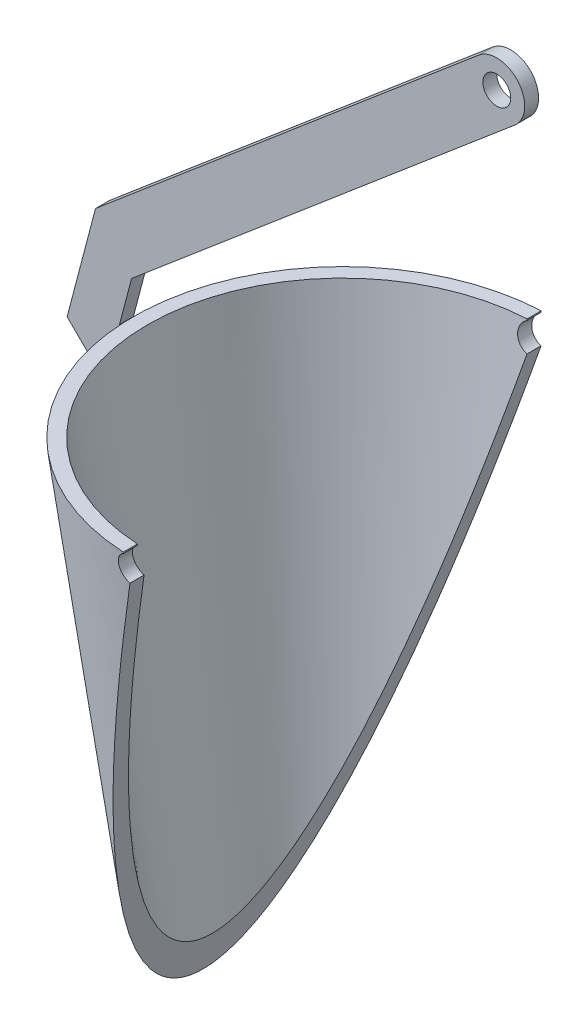
ISO-10303-21;
HEADER;
FILE_DESCRIPTION(('STEP AP214'),'2;1');
FILE_NAME('part.step','',(''),(''),'','','');
FILE_SCHEMA(('AUTOMOTIVE_DESIGN { 1 0 10303 214 1 1 1 1 }'));
ENDSEC;
DATA;
#1=APPLICATION_CONTEXT('core data for automotive mechanical design processes');
#2=APPLICATION_PROTOCOL_DEFINITION('international standard','automotive_design',2000,#1);
#3=PRODUCT_CONTEXT('',#1,'mechanical');
#4=PRODUCT('Part','Part','',(#3));
#5=PRODUCT_RELATED_PRODUCT_CATEGORY('part','',(#4));
#6=PRODUCT_DEFINITION_FORMATION('','',#4);
#7=PRODUCT_DEFINITION_CONTEXT('part definition',#1,'design');
#8=PRODUCT_DEFINITION('design','',#6,#7);
#9=PRODUCT_DEFINITION_SHAPE('','',#8);
#10=(LENGTH_UNIT() NAMED_UNIT(*) SI_UNIT(.MILLI.,.METRE.));
#11=(NAMED_UNIT(*) PLANE_ANGLE_UNIT() SI_UNIT($,.RADIAN.));
#12=(NAMED_UNIT(*) SI_UNIT($,.STERADIAN.) SOLID_ANGLE_UNIT());
#13=UNCERTAINTY_MEASURE_WITH_UNIT(LENGTH_MEASURE(1.E-05),#10,'distance_accuracy_value','');
#14=(GEOMETRIC_REPRESENTATION_CONTEXT(3) GLOBAL_UNCERTAINTY_ASSIGNED_CONTEXT((#13)) GLOBAL_UNIT_ASSIGNED_CONTEXT((#10,
#11,#12)) REPRESENTATION_CONTEXT('',''));
#15=CARTESIAN_POINT('',(0.,0.,0.));
#16=DIRECTION('',(0.,0.,1.));
#17=DIRECTION('',(1.,0.,0.));
#18=AXIS2_PLACEMENT_3D('',#15,#16,#17);
#19=CARTESIAN_POINT('',(38.2571990142961,89.1823743155606,3.175));
#20=DIRECTION('',(0.,0.,1.));
#21=DIRECTION('',(1.,0.,0.));
#22=AXIS2_PLACEMENT_3D('',#19,#20,#21);
#23=PLANE('',#22);
#24=DIRECTION('',(0.25449329927965,0.967074537262645,0.));
#25=VECTOR('',#24,1.);
#26=CARTESIAN_POINT('',(-47.625,0.,3.175));
#27=LINE('',#26,#25);
#28=CARTESIAN_POINT('',(-47.625,0.,3.175));
#29=VERTEX_POINT('',#28);
#30=CARTESIAN_POINT('',(-44.8685427340684,10.4745376105398,3.175));
#31=VERTEX_POINT('',#30);
#32=EDGE_CURVE('E148',#29,#31,#27,.T.);
#33=ORIENTED_EDGE('',*,*,#32,.T.);
#34=DIRECTION('',(0.763159873131717,0.646209724502488,0.));
#35=VECTOR('',#34,1.);
#36=CARTESIAN_POINT('',(42.3606307648869,84.3363091211743,3.175));
#37=LINE('',#36,#35);
#38=CARTESIAN_POINT('',(42.3606307648869,84.3363091211743,3.175));
#39=VERTEX_POINT('',#38);
#40=EDGE_CURVE('E101',#31,#39,#37,.T.);
#41=ORIENTED_EDGE('',*,*,#40,.T.);
#42=CARTESIAN_POINT('',(38.2571990142961,89.1823743155606,3.175));
#43=DIRECTION('',(0.,0.,1.));
#44=DIRECTION('',(1.,0.,0.));
#45=AXIS2_PLACEMENT_3D('',#42,#43,#44);
#46=CIRCLE('',#45,6.35);
#47=CARTESIAN_POINT('',(34.1537672637053,94.0284395099471,3.175));
#48=VERTEX_POINT('',#47);
#49=EDGE_CURVE('E160',#39,#48,#46,.T.);
#50=ORIENTED_EDGE('',*,*,#49,.T.);
#51=DIRECTION('',(-0.763159873131717,-0.646209724502488,0.));
#52=VECTOR('',#51,1.);
#53=CARTESIAN_POINT('',(-53.0754062352499,20.1666679993127,3.175));
#54=LINE('',#53,#52);
#55=CARTESIAN_POINT('',(-53.0754062352499,20.1666679993127,3.175));
#56=VERTEX_POINT('',#55);
#57=EDGE_CURVE('E117',#48,#56,#54,.T.);
#58=ORIENTED_EDGE('',*,*,#57,.T.);
#59=DIRECTION('',(-0.254493299279644,-0.967074537262646,0.));
#60=VECTOR('',#59,1.);
#61=CARTESIAN_POINT('',(-59.5395360369529,-4.39702524715854,3.175));
#62=LINE('',#61,#60);
#63=CARTESIAN_POINT('',(-59.5395360369529,-4.39702524715854,3.175));
#64=VERTEX_POINT('',#63);
#65=EDGE_CURVE('E111',#56,#64,#62,.T.);
#66=ORIENTED_EDGE('',*,*,#65,.T.);
#67=DIRECTION('',(0.710264466982709,-0.703934930900413,0.));
#68=VECTOR('',#67,1.);
#69=CARTESIAN_POINT('',(-59.5395360369529,-4.39702524715854,3.175));
#70=LINE('',#69,#68);
#71=CARTESIAN_POINT('',(-45.1729495212973,-18.6355836381403,3.175));
#72=VERTEX_POINT('',#71);
#73=EDGE_CURVE('E115',#64,#72,#70,.T.);
#74=ORIENTED_EDGE('',*,*,#73,.T.);
#75=DIRECTION('',(-0.130454512571388,0.991454295542544,0.));
#76=VECTOR('',#75,1.);
#77=CARTESIAN_POINT('',(-45.1729495212973,-18.6355836381403,3.175));
#78=LINE('',#77,#76);
#79=EDGE_CURVE('E61',#72,#29,#78,.T.);
#80=ORIENTED_EDGE('',*,*,#79,.T.);
#81=EDGE_LOOP('',(#33,#41,#50,#58,#66,#74,#80));
#82=FACE_BOUND('',#81,.T.);
#83=CARTESIAN_POINT('',(38.2571990142961,89.1823743155606,3.175));
#84=DIRECTION('',(0.,0.,1.));
#85=DIRECTION('',(1.,0.,0.));
#86=AXIS2_PLACEMENT_3D('',#83,#84,#85);
#87=CIRCLE('',#86,3.175);
#88=CARTESIAN_POINT('',(41.4321990142961,89.1823743155606,3.175));
#89=VERTEX_POINT('',#88);
#90=EDGE_CURVE('E139',#89,#89,#87,.T.);
#91=ORIENTED_EDGE('',*,*,#90,.F.);
#92=EDGE_LOOP('',(#91));
#93=FACE_BOUND('',#92,.T.);
#94=ADVANCED_FACE('F44',(#82,#93),#23,.T.);
#95=CARTESIAN_POINT('',(38.2571990142961,89.1823743155606,0.));
#96=DIRECTION('',(0.,0.,1.));
#97=DIRECTION('',(1.,0.,0.));
#98=AXIS2_PLACEMENT_3D('',#95,#96,#97);
#99=PLANE('',#98);
#100=DIRECTION('',(0.25449329927965,0.967074537262645,0.));
#101=VECTOR('',#100,1.);
#102=CARTESIAN_POINT('',(-47.625,0.,0.));
#103=LINE('',#102,#101);
#104=CARTESIAN_POINT('',(-47.625,0.,0.));
#105=VERTEX_POINT('',#104);
#106=CARTESIAN_POINT('',(-44.8685427340684,10.4745376105398,0.));
#107=VERTEX_POINT('',#106);
#108=EDGE_CURVE('E135',#105,#107,#103,.T.);
#109=ORIENTED_EDGE('',*,*,#108,.F.);
#110=DIRECTION('',(-0.130454512571388,0.991454295542544,0.));
#111=VECTOR('',#110,1.);
#112=CARTESIAN_POINT('',(-45.1729495212973,-18.6355836381403,0.));
#113=LINE('',#112,#111);
#114=CARTESIAN_POINT('',(-45.1729495212973,-18.6355836381403,0.));
#115=VERTEX_POINT('',#114);
#116=EDGE_CURVE('E93',#115,#105,#113,.T.);
#117=ORIENTED_EDGE('',*,*,#116,.F.);
#118=DIRECTION('',(0.710264466982709,-0.703934930900413,0.));
#119=VECTOR('',#118,1.);
#120=CARTESIAN_POINT('',(-59.5395360369529,-4.39702524715854,0.));
#121=LINE('',#120,#119);
#122=CARTESIAN_POINT('',(-59.5395360369529,-4.39702524715854,0.));
#123=VERTEX_POINT('',#122);
#124=EDGE_CURVE('E87',#123,#115,#121,.T.);
#125=ORIENTED_EDGE('',*,*,#124,.F.);
#126=DIRECTION('',(-0.254493299279644,-0.967074537262646,0.));
#127=VECTOR('',#126,1.);
#128=CARTESIAN_POINT('',(-59.5395360369529,-4.39702524715854,0.));
#129=LINE('',#128,#127);
#130=CARTESIAN_POINT('',(-53.0754062352499,20.1666679993127,0.));
#131=VERTEX_POINT('',#130);
#132=EDGE_CURVE('E125',#131,#123,#129,.T.);
#133=ORIENTED_EDGE('',*,*,#132,.F.);
#134=DIRECTION('',(-0.763159873131717,-0.646209724502488,0.));
#135=VECTOR('',#134,1.);
#136=CARTESIAN_POINT('',(-53.0754062352499,20.1666679993127,0.));
#137=LINE('',#136,#135);
#138=CARTESIAN_POINT('',(34.1537672637053,94.0284395099471,0.));
#139=VERTEX_POINT('',#138);
#140=EDGE_CURVE('E143',#139,#131,#137,.T.);
#141=ORIENTED_EDGE('',*,*,#140,.F.);
#142=CARTESIAN_POINT('',(38.2571990142961,89.1823743155606,0.));
#143=DIRECTION('',(0.,0.,1.));
#144=DIRECTION('',(1.,0.,0.));
#145=AXIS2_PLACEMENT_3D('',#142,#143,#144);
#146=CIRCLE('',#145,6.35);
#147=CARTESIAN_POINT('',(42.3606307648869,84.3363091211743,0.));
#148=VERTEX_POINT('',#147);
#149=EDGE_CURVE('E141',#148,#139,#146,.T.);
#150=ORIENTED_EDGE('',*,*,#149,.F.);
#151=DIRECTION('',(0.763159873131717,0.646209724502488,0.));
#152=VECTOR('',#151,1.);
#153=CARTESIAN_POINT('',(42.3606307648869,84.3363091211743,0.));
#154=LINE('',#153,#152);
#155=EDGE_CURVE('E138',#107,#148,#154,.T.);
#156=ORIENTED_EDGE('',*,*,#155,.F.);
#157=EDGE_LOOP('',(#109,#117,#125,#133,#141,#150,#156));
#158=FACE_BOUND('',#157,.T.);
#159=CARTESIAN_POINT('',(38.2571990142961,89.1823743155606,0.));
#160=DIRECTION('',(0.,0.,1.));
#161=DIRECTION('',(1.,0.,0.));
#162=AXIS2_PLACEMENT_3D('',#159,#160,#161);
#163=CIRCLE('',#162,3.175);
#164=CARTESIAN_POINT('',(41.4321990142961,89.1823743155606,0.));
#165=VERTEX_POINT('',#164);
#166=EDGE_CURVE('E172',#165,#165,#163,.T.);
#167=ORIENTED_EDGE('',*,*,#166,.T.);
#168=EDGE_LOOP('',(#167));
#169=FACE_BOUND('',#168,.T.);
#170=ADVANCED_FACE('F164',(#158,#169),#99,.F.);
#171=CARTESIAN_POINT('',(-47.625,0.,3.175));
#172=DIRECTION('',(-0.967074537262645,0.25449329927965,0.));
#173=DIRECTION('',(-0.25449329927965,-0.967074537262645,0.));
#174=AXIS2_PLACEMENT_3D('',#171,#172,#173);
#175=PLANE('',#174);
#176=ORIENTED_EDGE('',*,*,#108,.T.);
#177=DIRECTION('',(0.,0.,-1.));
#178=VECTOR('',#177,1.);
#179=CARTESIAN_POINT('',(-44.8685427340684,10.4745376105398,3.175));
#180=LINE('',#179,#178);
#181=EDGE_CURVE('E12',#31,#107,#180,.T.);
#182=ORIENTED_EDGE('',*,*,#181,.F.);
#183=ORIENTED_EDGE('',*,*,#32,.F.);
#184=DIRECTION('',(0.,0.,-1.));
#185=VECTOR('',#184,1.);
#186=CARTESIAN_POINT('',(-47.625,0.,3.175));
#187=LINE('',#186,#185);
#188=EDGE_CURVE('E131',#29,#105,#187,.T.);
#189=ORIENTED_EDGE('',*,*,#188,.T.);
#190=EDGE_LOOP('',(#176,#182,#183,#189));
#191=FACE_BOUND('',#190,.T.);
#192=ADVANCED_FACE('F46',(#191),#175,.F.);
#193=CARTESIAN_POINT('',(42.3606307648869,84.3363091211743,3.175));
#194=DIRECTION('',(-0.646209724502488,0.763159873131717,0.));
#195=DIRECTION('',(-0.763159873131717,-0.646209724502488,0.));
#196=AXIS2_PLACEMENT_3D('',#193,#194,#195);
#197=PLANE('',#196);
#198=ORIENTED_EDGE('',*,*,#155,.T.);
#199=DIRECTION('',(0.,0.,-1.));
#200=VECTOR('',#199,1.);
#201=CARTESIAN_POINT('',(42.3606307648869,84.3363091211743,3.175));
#202=LINE('',#201,#200);
#203=EDGE_CURVE('E53',#39,#148,#202,.T.);
#204=ORIENTED_EDGE('',*,*,#203,.F.);
#205=ORIENTED_EDGE('',*,*,#40,.F.);
#206=ORIENTED_EDGE('',*,*,#181,.T.);
#207=EDGE_LOOP('',(#198,#204,#205,#206));
#208=FACE_BOUND('',#207,.T.);
#209=ADVANCED_FACE('F198',(#208),#197,.F.);
#210=CARTESIAN_POINT('',(38.2571990142961,89.1823743155606,3.175));
#211=DIRECTION('',(0.,0.,-1.));
#212=DIRECTION('',(-1.,0.,0.));
#213=AXIS2_PLACEMENT_3D('',#210,#211,#212);
#214=CYLINDRICAL_SURFACE('',#213,6.35);
#215=ORIENTED_EDGE('',*,*,#149,.T.);
#216=DIRECTION('',(0.,0.,-1.));
#217=VECTOR('',#216,1.);
#218=CARTESIAN_POINT('',(34.1537672637053,94.0284395099471,3.175));
#219=LINE('',#218,#217);
#220=EDGE_CURVE('E152',#48,#139,#219,.T.);
#221=ORIENTED_EDGE('',*,*,#220,.F.);
#222=ORIENTED_EDGE('',*,*,#49,.F.);
#223=ORIENTED_EDGE('',*,*,#203,.T.);
#224=EDGE_LOOP('',(#215,#221,#222,#223));
#225=FACE_BOUND('',#224,.T.);
#226=ADVANCED_FACE('F158',(#225),#214,.T.);
#227=CARTESIAN_POINT('',(-53.0754062352499,20.1666679993127,3.175));
#228=DIRECTION('',(0.646209724502488,-0.763159873131717,0.));
#229=DIRECTION('',(0.763159873131717,0.646209724502488,0.));
#230=AXIS2_PLACEMENT_3D('',#227,#228,#229);
#231=PLANE('',#230);
#232=ORIENTED_EDGE('',*,*,#140,.T.);
#233=DIRECTION('',(0.,0.,-1.));
#234=VECTOR('',#233,1.);
#235=CARTESIAN_POINT('',(-53.0754062352499,20.1666679993127,3.175));
#236=LINE('',#235,#234);
#237=EDGE_CURVE('E126',#56,#131,#236,.T.);
#238=ORIENTED_EDGE('',*,*,#237,.F.);
#239=ORIENTED_EDGE('',*,*,#57,.F.);
#240=ORIENTED_EDGE('',*,*,#220,.T.);
#241=EDGE_LOOP('',(#232,#238,#239,#240));
#242=FACE_BOUND('',#241,.T.);
#243=ADVANCED_FACE('F167',(#242),#231,.F.);
#244=CARTESIAN_POINT('',(-59.5395360369529,-4.39702524715854,3.175));
#245=DIRECTION('',(0.967074537262646,-0.254493299279644,0.));
#246=DIRECTION('',(0.254493299279644,0.967074537262646,0.));
#247=AXIS2_PLACEMENT_3D('',#244,#245,#246);
#248=PLANE('',#247);
#249=ORIENTED_EDGE('',*,*,#132,.T.);
#250=DIRECTION('',(0.,0.,-1.));
#251=VECTOR('',#250,1.);
#252=CARTESIAN_POINT('',(-59.5395360369529,-4.39702524715854,3.175));
#253=LINE('',#252,#251);
#254=EDGE_CURVE('E122',#64,#123,#253,.T.);
#255=ORIENTED_EDGE('',*,*,#254,.F.);
#256=ORIENTED_EDGE('',*,*,#65,.F.);
#257=ORIENTED_EDGE('',*,*,#237,.T.);
#258=EDGE_LOOP('',(#249,#255,#256,#257));
#259=FACE_BOUND('',#258,.T.);
#260=ADVANCED_FACE('F123',(#259),#248,.F.);
#261=CARTESIAN_POINT('',(-59.5395360369529,-4.39702524715854,3.175));
#262=DIRECTION('',(0.703934930900413,0.710264466982708,0.));
#263=DIRECTION('',(-0.710264466982708,0.703934930900413,0.));
#264=AXIS2_PLACEMENT_3D('',#261,#262,#263);
#265=PLANE('',#264);
#266=ORIENTED_EDGE('',*,*,#124,.T.);
#267=DIRECTION('',(0.,0.,-1.));
#268=VECTOR('',#267,1.);
#269=CARTESIAN_POINT('',(-45.1729495212973,-18.6355836381403,3.175));
#270=LINE('',#269,#268);
#271=EDGE_CURVE('E127',#72,#115,#270,.T.);
#272=ORIENTED_EDGE('',*,*,#271,.F.);
#273=ORIENTED_EDGE('',*,*,#73,.F.);
#274=ORIENTED_EDGE('',*,*,#254,.T.);
#275=EDGE_LOOP('',(#266,#272,#273,#274));
#276=FACE_BOUND('',#275,.T.);
#277=ADVANCED_FACE('F129',(#276),#265,.F.);
#278=CARTESIAN_POINT('',(-45.1729495212973,-18.6355836381403,3.175));
#279=DIRECTION('',(-0.991454295542544,-0.130454512571388,0.));
#280=DIRECTION('',(0.130454512571388,-0.991454295542544,0.));
#281=AXIS2_PLACEMENT_3D('',#278,#279,#280);
#282=PLANE('',#281);
#283=ORIENTED_EDGE('',*,*,#116,.T.);
#284=ORIENTED_EDGE('',*,*,#188,.F.);
#285=ORIENTED_EDGE('',*,*,#79,.F.);
#286=ORIENTED_EDGE('',*,*,#271,.T.);
#287=EDGE_LOOP('',(#283,#284,#285,#286));
#288=FACE_BOUND('',#287,.T.);
#289=ADVANCED_FACE('F188',(#288),#282,.F.);
#290=CARTESIAN_POINT('',(38.2571990142961,89.1823743155606,3.175));
#291=DIRECTION('',(0.,0.,-1.));
#292=DIRECTION('',(-1.,0.,0.));
#293=AXIS2_PLACEMENT_3D('',#290,#291,#292);
#294=CYLINDRICAL_SURFACE('',#293,3.175);
#295=ORIENTED_EDGE('',*,*,#90,.T.);
#296=EDGE_LOOP('',(#295));
#297=FACE_BOUND('',#296,.T.);
#298=ORIENTED_EDGE('',*,*,#166,.F.);
#299=EDGE_LOOP('',(#298));
#300=FACE_BOUND('',#299,.T.);
#301=ADVANCED_FACE('F178',(#297,#300),#294,.F.);
#302=CLOSED_SHELL('',(#94,#170,#192,#209,#226,#243,#260,#277,#289,#301));
#303=MANIFOLD_SOLID_BREP('B2',#302);
#304=CARTESIAN_POINT('',(0.,0.,0.));
#305=DIRECTION('',(0.,1.,0.));
#306=DIRECTION('',(0.,0.,1.));
#307=AXIS2_PLACEMENT_3D('',#304,#305,#306);
#308=CONICAL_SURFACE('',#307,47.625,0.130827396074057);
#309=CARTESIAN_POINT('',(-2.3576984319281,-85.4257428393814,-36.3083020185411));
#310=CARTESIAN_POINT('',(-2.3576984319281,-74.7891514308423,-37.7107891372062));
#311=CARTESIAN_POINT('',(-2.3576984319281,-64.1525189981991,-39.1129650723552));
#312=CARTESIAN_POINT('',(-2.3576984319281,-42.8791898140212,-41.9168288891303));
#313=CARTESIAN_POINT('',(-2.3576984319281,-32.2424930624864,-43.3185167707568));
#314=CARTESIAN_POINT('',(-2.3576984319281,-15.2228595743059,-45.561050525857));
#315=CARTESIAN_POINT('',(-2.3576984319281,-8.83993774935593,-46.4020095778413));
#316=CARTESIAN_POINT('',(-2.3576984319281,11.3712016125491,-49.0646815310176));
#317=CARTESIAN_POINT('',(-2.3576984319281,25.1994455039221,-50.8861943877959));
#318=CARTESIAN_POINT('',(-2.3576984319281,52.8559826261927,-54.5288454612705));
#319=CARTESIAN_POINT('',(-2.3576984319281,66.6842758570902,-56.349983677967));
#320=CARTESIAN_POINT('',(-2.3576984319281,80.5125849426066,-58.1710014616296));
#321=B_SPLINE_CURVE_WITH_KNOTS('',3,(#309,#310,#311,#312,#313,#314,#315,#316,#317,#318,#319,
#320),.UNSPECIFIED.,.F.,.F.,(4,2,2,2,2,4),(0.,32.1859662162125,64.3719324071345,83.686179178142,
125.529268730431,167.372358267696),.UNSPECIFIED.);
#322=CARTESIAN_POINT('',(-2.3576984319281,-0.299340933395278,-47.5271693458428));
#323=VERTEX_POINT('',#322);
#324=CARTESIAN_POINT('',(-2.3576984319281,0.,-47.5666047043941));
#325=VERTEX_POINT('',#324);
#326=EDGE_CURVE('E316',#323,#325,#321,.T.);
#327=ORIENTED_EDGE('',*,*,#326,.F.);
#328=CARTESIAN_POINT('',(0.0002,-6.14087067307397,-46.8169907004841));
#329=CARTESIAN_POINT('',(-0.0859535615366576,-6.1635575906585,-46.8140083255328));
#330=CARTESIAN_POINT('',(-0.173069972905161,-6.18260256961136,-46.8112626520907));
#331=CARTESIAN_POINT('',(-0.348604181921856,-6.21330914503569,-46.8062428556978));
#332=CARTESIAN_POINT('',(-0.437021924190166,-6.22497105477927,-46.8039687127421));
#333=CARTESIAN_POINT('',(-0.614483808090249,-6.24080874440042,-46.7998912067551));
#334=CARTESIAN_POINT('',(-0.703527501892061,-6.24498941871323,-46.7980875365875));
#335=CARTESIAN_POINT('',(-0.881634578482085,-6.24585885466165,-46.794957010748));
#336=CARTESIAN_POINT('',(-0.97069796098784,-6.24254771758166,-46.7936301486303));
#337=CARTESIAN_POINT('',(-1.23707078071162,-6.22136607338411,-46.7903839699077));
#338=CARTESIAN_POINT('',(-1.41363326367239,-6.1922535546468,-46.7891974465898));
#339=CARTESIAN_POINT('',(-1.75924806261013,-6.1048635127957,-46.7889860982543));
#340=CARTESIAN_POINT('',(-1.92830197095091,-6.0465922059299,-46.7899608126427));
#341=CARTESIAN_POINT('',(-2.2541218904275,-5.90261270866256,-46.7943626040565));
#342=CARTESIAN_POINT('',(-2.41089772227584,-5.81692673094493,-46.7977876984339));
#343=CARTESIAN_POINT('',(-2.70784851609873,-5.62055169907562,-46.8074275887588));
#344=CARTESIAN_POINT('',(-2.84802109967478,-5.50985906933313,-46.8136427837761));
#345=CARTESIAN_POINT('',(-3.10764899424079,-5.26679990758813,-46.8291770152161));
#346=CARTESIAN_POINT('',(-3.22712458900852,-5.1344548459808,-46.838492986303));
#347=CARTESIAN_POINT('',(-3.44217397459419,-4.85185551890092,-46.8604652175612));
#348=CARTESIAN_POINT('',(-3.53774942441571,-4.70160249756036,-46.8731212457604));
#349=CARTESIAN_POINT('',(-3.70248907060873,-4.38733818345879,-46.9018763893385));
#350=CARTESIAN_POINT('',(-3.77162260268284,-4.22331118432241,-46.9179794686758));
#351=CARTESIAN_POINT('',(-3.88150867923253,-3.8863522572301,-46.9535049354716));
#352=CARTESIAN_POINT('',(-3.92225984777483,-3.71341989799241,-46.972927483796));
#353=CARTESIAN_POINT('',(-3.97455966239676,-3.36249807730973,-47.014870183623));
#354=CARTESIAN_POINT('',(-3.98593297661624,-3.1844846347946,-47.037408091211));
#355=CARTESIAN_POINT('',(-3.97882818024165,-2.82938037204817,-47.0849004128425));
#356=CARTESIAN_POINT('',(-3.96034834980661,-2.65228960556192,-47.1098549660313));
#357=CARTESIAN_POINT('',(-3.89384020727525,-2.30207912569136,-47.1616360574095));
#358=CARTESIAN_POINT('',(-3.84550660100344,-2.12901986244251,-47.1884793646362));
#359=CARTESIAN_POINT('',(-3.72044872378317,-1.79358927186742,-47.2427756221344));
#360=CARTESIAN_POINT('',(-3.64372412992355,-1.63121806612892,-47.2702285793364));
#361=CARTESIAN_POINT('',(-3.46328243133634,-1.32039413560554,-47.3247992976463));
#362=CARTESIAN_POINT('',(-3.35935546000028,-1.17206240525648,-47.3519126550963));
#363=CARTESIAN_POINT('',(-3.1275874032091,-0.894952249203227,-47.4043256029943));
#364=CARTESIAN_POINT('',(-2.99973817848236,-0.766180505657205,-47.4296245720531));
#365=CARTESIAN_POINT('',(-2.72401471267033,-0.532312337102052,-47.4770801224201));
#366=CARTESIAN_POINT('',(-2.57618833612549,-0.42716087472294,-47.4992439632404));
#367=CARTESIAN_POINT('',(-2.26449456401252,-0.243467215911044,-47.5393179657162));
#368=CARTESIAN_POINT('',(-2.10065552388843,-0.164879043241523,-47.5572354607902));
#369=CARTESIAN_POINT('',(-1.87958564676588,-0.0812398233384438,-47.5772262368721));
#370=CARTESIAN_POINT('',(-1.82730502204217,-0.0630124158872855,-47.5816637844773));
#371=CARTESIAN_POINT('',(-1.72190806852856,-0.0293315045444924,-47.5900287551245));
#372=CARTESIAN_POINT('',(-1.6687931715082,-0.0138737154337185,-47.5939569635795));
#373=CARTESIAN_POINT('',(-1.61527206789541,0.000199999999974752,-47.5976262824767));
#374=B_SPLINE_CURVE_WITH_KNOTS('',3,(#328,#329,#330,#331,#332,#333,#334,#335,#336,#337,#338,
#339,#340,#341,#342,#343,#344,#345,#346,#347,#348,#349,#350,#351,#352,#353,#354,#355,#356,#357,
#358,#359,#360,#361,#362,#363,#364,#365,#366,#367,#368,#369,#370,#371,#372,#373),.UNSPECIFIED.,
.F.,.F.,(4,2,2,2,2,2,2,2,2,2,2,2,2,2,2,2,2,2,2,2,2,2,4),(0.,0.267334898742274,0.534658453397227,
0.801807053413805,1.06895204177679,1.60303269053914,2.13699952921359,2.67053481331776,
3.20414643361655,3.73723210023411,4.27028075298946,4.80394571341583,5.33763654329753,
5.87450524536216,6.4114048775593,6.95388805872521,7.49637741013286,8.0431821900713,
8.59017335346249,9.13587644356972,9.68063012527912,9.8472096775258,10.0135292254064),.UNSPECIFIED.);
#375=CARTESIAN_POINT('',(-1.61603245042574,-6.1409233116178,-46.7890842920424));
#376=VERTEX_POINT('',#375);
#377=EDGE_CURVE('E337',#376,#323,#374,.T.);
#378=ORIENTED_EDGE('',*,*,#377,.F.);
#379=CARTESIAN_POINT('',(31.7499999999999,120.65,0.));
#380=DIRECTION('',(-0.967074537262646,0.254493299279644,0.));
#381=DIRECTION('',(0.254493299279644,0.967074537262646,0.));
#382=AXIS2_PLACEMENT_3D('',#379,#380,#381);
#383=ELLIPSE('',#382,249.515410345734,54.9926131403118);
#384=CARTESIAN_POINT('',(-1.61603245042574,-6.1409233116178,46.7890842920424));
#385=VERTEX_POINT('',#384);
#386=EDGE_CURVE('E344',#385,#376,#383,.F.);
#387=ORIENTED_EDGE('',*,*,#386,.F.);
#388=CARTESIAN_POINT('',(-1.61527206789541,0.000199999999972751,47.5976262824767));
#389=CARTESIAN_POINT('',(-1.70165680488474,-0.0225005797584953,47.5917080652622));
#390=CARTESIAN_POINT('',(-1.787027770769,-0.048850291645772,47.5851039222109));
#391=CARTESIAN_POINT('',(-1.95514421860819,-0.108593207582253,47.5706243991864));
#392=CARTESIAN_POINT('',(-2.03789007574798,-0.14198539984378,47.5627492018628));
#393=CARTESIAN_POINT('',(-2.2000722524518,-0.215514727377125,47.5458380291236));
#394=CARTESIAN_POINT('',(-2.27951295389418,-0.255642552489486,47.5368036599507));
#395=CARTESIAN_POINT('',(-2.43463709995546,-0.342342250030682,47.5176887062314));
#396=CARTESIAN_POINT('',(-2.51032049591488,-0.388914205885497,47.5076081081409));
#397=CARTESIAN_POINT('',(-2.73095064508586,-0.537803825091363,47.4759848389561));
#398=CARTESIAN_POINT('',(-2.86962225785265,-0.649361203596843,47.4530453469536));
#399=CARTESIAN_POINT('',(-3.12614263053469,-0.893688275587248,47.4046205142511));
#400=CARTESIAN_POINT('',(-3.24399001267651,-1.02645937150904,47.3791350052761));
#401=CARTESIAN_POINT('',(-3.45722665292289,-1.31138545831389,47.3264661795455));
#402=CARTESIAN_POINT('',(-3.55231279517059,-1.46376451136674,47.2992654570573));
#403=CARTESIAN_POINT('',(-3.71548982918682,-1.78233688782131,47.2446813668679));
#404=CARTESIAN_POINT('',(-3.78357669418197,-1.94853226737391,47.2172979725411));
#405=CARTESIAN_POINT('',(-3.89129886591058,-2.29162214653277,47.1632468293628));
#406=CARTESIAN_POINT('',(-3.93068609371327,-2.46859593207286,47.1365871947108));
#407=CARTESIAN_POINT('',(-3.97882022449424,-2.82693594599629,47.0852310096394));
#408=CARTESIAN_POINT('',(-3.98756918240646,-3.0083018789731,47.0605343276717));
#409=CARTESIAN_POINT('',(-3.9740457072788,-3.36944234536974,47.0139904499629));
#410=CARTESIAN_POINT('',(-3.95190850232363,-3.54922036963913,46.9921312879227));
#411=CARTESIAN_POINT('',(-3.87730686386501,-3.90275521237815,46.951669259335));
#412=CARTESIAN_POINT('',(-3.8248436021334,-4.07651226321788,46.9330662670083));
#413=CARTESIAN_POINT('',(-3.69167172667507,-4.41106940494977,46.8995707871393));
#414=CARTESIAN_POINT('',(-3.61126852764152,-4.57198735392106,46.8846410450157));
#415=CARTESIAN_POINT('',(-3.42431625247304,-4.87815830534554,46.858272440914));
#416=CARTESIAN_POINT('',(-3.31776842558669,-5.02341205579182,46.8468334122004));
#417=CARTESIAN_POINT('',(-3.08249553410322,-5.29287122899746,46.8273673478668));
#418=CARTESIAN_POINT('',(-2.95395589679708,-5.41723667482636,46.8193135875256));
#419=CARTESIAN_POINT('',(-2.67775983257388,-5.64270969057607,46.8062051619957));
#420=CARTESIAN_POINT('',(-2.53010471733168,-5.74381885498675,46.8011502911604));
#421=CARTESIAN_POINT('',(-2.22032174767254,-5.91961062597856,46.7937110400563));
#422=CARTESIAN_POINT('',(-2.05823611713656,-5.99436735091303,46.7913191283783));
#423=CARTESIAN_POINT('',(-1.72376392046134,-6.11573382776528,46.7888537829962));
#424=CARTESIAN_POINT('',(-1.55137398433179,-6.16233431531188,46.7887811119949));
#425=CARTESIAN_POINT('',(-1.20108006262776,-6.22607217338517,46.790695175252));
#426=CARTESIAN_POINT('',(-1.02317024542192,-6.24317722335031,46.7926841648255));
#427=CARTESIAN_POINT('',(-0.667184423613708,-6.24731114875049,46.7985669936619));
#428=CARTESIAN_POINT('',(-0.489109113702571,-6.23438700443227,46.80245784996));
#429=CARTESIAN_POINT('',(-0.260750579714168,-6.19840158917314,46.8087249100244));
#430=CARTESIAN_POINT('',(-0.208108481402077,-6.18873160905855,46.8102600749724));
#431=CARTESIAN_POINT('',(-0.103470179009373,-6.16676331669476,46.8134984453654));
#432=CARTESIAN_POINT('',(-0.0514730639023389,-6.15446930357663,46.8152013735246));
#433=CARTESIAN_POINT('',(0.000200000000000146,-6.14087067307397,46.8169907004841));
#434=B_SPLINE_CURVE_WITH_KNOTS('',3,(#388,#389,#390,#391,#392,#393,#394,#395,#396,#397,#398,
#399,#400,#401,#402,#403,#404,#405,#406,#407,#408,#409,#410,#411,#412,#413,#414,#415,#416,#417,
#418,#419,#420,#421,#422,#423,#424,#425,#426,#427,#428,#429,#430,#431,#432,#433),.UNSPECIFIED.,
.F.,.F.,(4,2,2,2,2,2,2,2,2,2,2,2,2,2,2,2,2,2,2,2,2,2,4),(0.,0.268446262251367,0.536853983277696,
0.804893714285317,1.07293691567096,1.60854949679235,2.14419750187345,2.68662487260567,
3.22913311258876,3.77627688150676,4.32338395233978,4.86810314109607,5.41280128379472,
5.95172341475582,6.49061979982898,7.02517816008206,7.55969985918058,8.09270594738243,
8.62588731756149,9.15965256774745,9.69258331220272,9.85317141379237,10.0134984053597),.UNSPECIFIED.);
#435=CARTESIAN_POINT('',(-2.35769843192963,-0.299340933393362,47.5271693458431));
#436=VERTEX_POINT('',#435);
#437=EDGE_CURVE('E385',#436,#385,#434,.T.);
#438=ORIENTED_EDGE('',*,*,#437,.F.);
#439=CARTESIAN_POINT('',(-2.3576984319281,80.5125849426066,58.1710014616296));
#440=CARTESIAN_POINT('',(-2.3576984319281,66.6842754508256,56.3499866469969));
#441=CARTESIAN_POINT('',(-2.3576984319281,52.8559824031198,54.5288469431601));
#442=CARTESIAN_POINT('',(-2.3576984319281,25.1994456738202,50.886192898905));
#443=CARTESIAN_POINT('',(-2.3576984319281,11.3712019922262,49.0646785584873));
#444=CARTESIAN_POINT('',(-2.3576984319281,-16.2852195836796,45.4211503754189));
#445=CARTESIAN_POINT('',(-2.3576984319281,-30.1133974779914,43.5991365327677));
#446=CARTESIAN_POINT('',(-2.3576984319281,-57.7696534930842,39.954351623275));
#447=CARTESIAN_POINT('',(-2.3576984319281,-71.5977316138651,38.1315805564323));
#448=CARTESIAN_POINT('',(-2.3576984319281,-85.4257428393814,36.3083020185411));
#449=B_SPLINE_CURVE_WITH_KNOTS('',3,(#439,#440,#441,#442,#443,#444,#445,#446,#447,#448),
.UNSPECIFIED.,.F.,.F.,(4,2,2,2,4),(0.,41.8430895774902,83.6861790895541,125.52926864261,
167.372358262684),.UNSPECIFIED.);
#450=CARTESIAN_POINT('',(-2.3576984319281,0.,47.566604704394));
#451=VERTEX_POINT('',#450);
#452=EDGE_CURVE('E281',#451,#436,#449,.T.);
#453=ORIENTED_EDGE('',*,*,#452,.F.);
#454=CARTESIAN_POINT('',(0.,0.,0.));
#455=DIRECTION('',(0.,1.,0.));
#456=DIRECTION('',(0.,0.,1.));
#457=AXIS2_PLACEMENT_3D('',#454,#455,#456);
#458=CIRCLE('',#457,47.625);
#459=EDGE_CURVE('E331',#325,#451,#458,.T.);
#460=ORIENTED_EDGE('',*,*,#459,.F.);
#461=EDGE_LOOP('',(#327,#378,#387,#438,#453,#460));
#462=FACE_BOUND('',#461,.T.);
#463=ADVANCED_FACE('F266',(#462),#308,.T.);
#464=CARTESIAN_POINT('',(0.,0.,0.));
#465=DIRECTION('',(0.,1.,0.));
#466=DIRECTION('',(0.,0.,1.));
#467=AXIS2_PLACEMENT_3D('',#464,#465,#466);
#468=PLANE('',#467);
#469=DIRECTION('',(0.,0.,1.));
#470=VECTOR('',#469,1.);
#471=CARTESIAN_POINT('',(-2.3576984319281,0.,-47.625));
#472=LINE('',#471,#470);
#473=CARTESIAN_POINT('',(-2.3576984319281,0.,-44.360022849184));
#474=VERTEX_POINT('',#473);
#475=EDGE_CURVE('E319',#325,#474,#472,.T.);
#476=ORIENTED_EDGE('',*,*,#475,.F.);
#477=ORIENTED_EDGE('',*,*,#459,.T.);
#478=CARTESIAN_POINT('',(-2.3576984319281,0.,44.360022849184));
#479=VERTEX_POINT('',#478);
#480=EDGE_CURVE('E334',#479,#451,#472,.T.);
#481=ORIENTED_EDGE('',*,*,#480,.F.);
#482=CARTESIAN_POINT('',(0.,0.,0.));
#483=DIRECTION('',(0.,1.,0.));
#484=DIRECTION('',(0.,0.,1.));
#485=AXIS2_PLACEMENT_3D('',#482,#483,#484);
#486=CIRCLE('',#485,44.4226335225192);
#487=EDGE_CURVE('E333',#474,#479,#486,.T.);
#488=ORIENTED_EDGE('',*,*,#487,.F.);
#489=EDGE_LOOP('',(#476,#477,#481,#488));
#490=FACE_BOUND('',#489,.T.);
#491=ADVANCED_FACE('F329',(#490),#468,.T.);
#492=CARTESIAN_POINT('',(0.,0.,0.));
#493=DIRECTION('',(0.,1.,0.));
#494=DIRECTION('',(0.,0.,1.));
#495=AXIS2_PLACEMENT_3D('',#492,#493,#494);
#496=CONICAL_SURFACE('',#495,44.4226335225192,0.130827396074059);
#497=CARTESIAN_POINT('',(0.000200000000021364,-6.14087067307397,-43.6146242229719));
#498=CARTESIAN_POINT('',(-0.0859817693028889,-6.16356500625561,-43.6116410771594));
#499=CARTESIAN_POINT('',(-0.173126417867153,-6.18261488838617,-43.6088769846872));
#500=CARTESIAN_POINT('',(-0.34871686245853,-6.21332641371071,-43.6037839226327));
#501=CARTESIAN_POINT('',(-0.437162602827634,-6.22498837200976,-43.6014549344955));
#502=CARTESIAN_POINT('',(-0.614680265378504,-6.24082150926726,-43.597230219233));
#503=CARTESIAN_POINT('',(-0.703751742334503,-6.24499756076904,-43.5953342109848));
#504=CARTESIAN_POINT('',(-0.881913705006321,-6.24585313978944,-43.5919818839158));
#505=CARTESIAN_POINT('',(-0.97100419045116,-6.24253276785518,-43.5905255591981));
#506=CARTESIAN_POINT('',(-1.23745687870963,-6.22131658106516,-43.5868366394147));
#507=CARTESIAN_POINT('',(-1.41407091332156,-6.19217193272998,-43.585282420752));
#508=CARTESIAN_POINT('',(-1.75978428952386,-6.10469876768072,-43.5842141729828));
#509=CARTESIAN_POINT('',(-1.92888522225384,-6.04637646265557,-43.5846997097914));
#510=CARTESIAN_POINT('',(-2.25478602316279,-5.90227713502679,-43.5880405901925));
#511=CARTESIAN_POINT('',(-2.41159617131521,-5.81652336778739,-43.5908939297052));
#512=CARTESIAN_POINT('',(-2.70860474392263,-5.61999276925585,-43.5993572206542));
#513=CARTESIAN_POINT('',(-2.84880081982857,-5.50921240664596,-43.6049675612419));
#514=CARTESIAN_POINT('',(-3.10841390189539,-5.26600012219649,-43.6193131117753));
#515=CARTESIAN_POINT('',(-3.22785812432561,-5.13359700803439,-43.6280441821683));
#516=CARTESIAN_POINT('',(-3.44283484123221,-4.85088026792415,-43.6489221666025));
#517=CARTESIAN_POINT('',(-3.53836908343441,-4.70056795225468,-43.6610688308394));
#518=CARTESIAN_POINT('',(-3.70296539846347,-4.3862808618094,-43.6889199863837));
#519=CARTESIAN_POINT('',(-3.77201183139062,-4.22229808456082,-43.70462657099));
#520=CARTESIAN_POINT('',(-3.8817424625355,-3.88545387767237,-43.7395136542949));
#521=CARTESIAN_POINT('',(-3.92242536013117,-3.71259204126964,-43.758694312248));
#522=CARTESIAN_POINT('',(-3.97460705261659,-3.36189459193956,-43.8003200004094));
#523=CARTESIAN_POINT('',(-3.98593960396189,-3.18403638978762,-43.8227828676463));
#524=CARTESIAN_POINT('',(-3.97881032277752,-2.82926871507501,-43.8703023360327));
#525=CARTESIAN_POINT('',(-3.96034671565912,-2.65235929965146,-43.8953590915847));
#526=CARTESIAN_POINT('',(-3.89392507768241,-2.30244699561624,-43.9475228280958));
#527=CARTESIAN_POINT('',(-3.84564925951568,-2.12950730476823,-43.9746491014808));
#528=CARTESIAN_POINT('',(-3.72075818161641,-1.79431486569357,-44.0296533044111));
#529=CARTESIAN_POINT('',(-3.64414244031948,-1.6320622991224,-44.0575312467216));
#530=CARTESIAN_POINT('',(-3.46388328938538,-1.32130515091389,-44.1130859774709));
#531=CARTESIAN_POINT('',(-3.3600052366931,-1.17293588568468,-44.1407587629289));
#532=CARTESIAN_POINT('',(-3.1283294779116,-0.895743493795395,-44.194345613395));
#533=CARTESIAN_POINT('',(-3.0005235058873,-0.766927149650078,-44.2202590664112));
#534=CARTESIAN_POINT('',(-2.72479584231959,-0.532894922461276,-44.2689559392025));
#535=CARTESIAN_POINT('',(-2.57691129108006,-0.4276363937471,-44.2917449854881));
#536=CARTESIAN_POINT('',(-2.26505732757031,-0.243749810413164,-44.3330110790708));
#537=CARTESIAN_POINT('',(-2.10111648782723,-0.165075520495737,-44.3514955952134));
#538=CARTESIAN_POINT('',(-1.8798719028163,-0.0813413730875843,-44.3721580214364));
#539=CARTESIAN_POINT('',(-1.8275369991555,-0.0630899363447106,-44.3767487341776));
#540=CARTESIAN_POINT('',(-1.72202716953486,-0.029366203063003,-44.3854085356394));
#541=CARTESIAN_POINT('',(-1.66885367737996,-0.0138896263160798,-44.3894784249026));
#542=CARTESIAN_POINT('',(-1.61527206789541,0.00019999999997468,-44.3932833124197));
#543=B_SPLINE_CURVE_WITH_KNOTS('',3,(#497,#498,#499,#500,#501,#502,#503,#504,#505,#506,#507,
#508,#509,#510,#511,#512,#513,#514,#515,#516,#517,#518,#519,#520,#521,#522,#523,#524,#525,#526,
#527,#528,#529,#530,#531,#532,#533,#534,#535,#536,#537,#538,#539,#540,#541,#542),.UNSPECIFIED.,
.F.,.F.,(4,2,2,2,2,2,2,2,2,2,2,2,2,2,2,2,2,2,2,2,2,2,4),(0.,0.26742236488337,0.534833323068605,
0.80207016136614,1.06930341532303,1.60355991885881,2.13770273184292,2.67139391336029,
3.20516044717955,3.73822156767703,4.27124371210849,4.80458010029626,5.33794094324423,
5.87431625849059,6.41072352016109,6.95294981225607,7.49518531852086,8.04225021843718,
8.58950445260827,9.13575985628361,9.68106026310074,9.84785376255217,10.01438772794),.UNSPECIFIED.);
#544=CARTESIAN_POINT('',(-1.61603245042574,-6.1409233116178,-43.5846679591535));
#545=VERTEX_POINT('',#544);
#546=CARTESIAN_POINT('',(-2.3576984319281,-0.299340933395277,-44.3205802432311));
#547=VERTEX_POINT('',#546);
#548=EDGE_CURVE('E341',#545,#547,#543,.T.);
#549=ORIENTED_EDGE('',*,*,#548,.T.);
#550=CARTESIAN_POINT('',(-2.3576984319281,-79.728466088099,-33.850036863529));
#551=CARTESIAN_POINT('',(-2.3576984319281,-69.8089486581742,-35.1583857957728));
#552=CARTESIAN_POINT('',(-2.3576984319281,-59.889387188677,-36.4664007675362));
#553=CARTESIAN_POINT('',(-2.3576984319281,-40.0501952129891,-39.081906982653));
#554=CARTESIAN_POINT('',(-2.3576984319281,-30.1305647067985,-40.3893982260069));
#555=CARTESIAN_POINT('',(-2.3576984319281,-14.2583259818897,-42.4811846894025));
#556=CARTESIAN_POINT('',(-2.3576984319281,-8.3057337655441,-43.2656013419135));
#557=CARTESIAN_POINT('',(-2.3576984319281,10.5428493138527,-45.7492299254328));
#558=CARTESIAN_POINT('',(-2.3576984319281,23.4388684569542,-47.4482272355056));
#559=CARTESIAN_POINT('',(-2.3576984319281,49.2309596800717,-50.8458199548927));
#560=CARTESIAN_POINT('',(-2.3576984319281,62.1270317600876,-52.5444153642072));
#561=CARTESIAN_POINT('',(-2.3576984319281,75.0231208463641,-54.2428816024648));
#562=B_SPLINE_CURVE_WITH_KNOTS('',3,(#550,#551,#552,#553,#554,#555,#556,#557,#558,#559,#560,
#561),.UNSPECIFIED.,.F.,.F.,(4,2,2,2,2,4),(0.,30.0162860074146,60.0325719836,78.044733768975,
117.067100608045,156.089467428557),.UNSPECIFIED.);
#563=EDGE_CURVE('E289',#547,#474,#562,.T.);
#564=ORIENTED_EDGE('',*,*,#563,.T.);
#565=ORIENTED_EDGE('',*,*,#487,.T.);
#566=CARTESIAN_POINT('',(-2.3576984319281,75.0231208463641,54.2428816024648));
#567=CARTESIAN_POINT('',(-2.3576984319281,62.1270313212361,52.5444185530772));
#568=CARTESIAN_POINT('',(-2.3576984319281,49.2309594360284,50.8458215460862));
#569=CARTESIAN_POINT('',(-2.3576984319281,23.4388686353508,47.4482256356677));
#570=CARTESIAN_POINT('',(-2.3576984319281,10.5428497198807,45.749226732241));
#571=CARTESIAN_POINT('',(-2.3576984319281,-15.2491175215327,42.3506930384875));
#572=CARTESIAN_POINT('',(-2.3576984319281,-28.145065847476,40.65115824816));
#573=CARTESIAN_POINT('',(-2.3576984319281,-53.9368554146284,37.2512761251881));
#574=CARTESIAN_POINT('',(-2.3576984319281,-66.8326966558372,35.550928792542));
#575=CARTESIAN_POINT('',(-2.3576984319281,-79.728466088099,33.850036863529));
#576=B_SPLINE_CURVE_WITH_KNOTS('',3,(#566,#567,#568,#569,#570,#571,#572,#573,#574,#575),
.UNSPECIFIED.,.F.,.F.,(4,2,2,2,4),(0.,39.0223668701718,78.044733659582,117.067100499611,
156.089467422369),.UNSPECIFIED.);
#577=CARTESIAN_POINT('',(-2.3576984319281,-0.299340933395278,44.3205802432311));
#578=VERTEX_POINT('',#577);
#579=EDGE_CURVE('E391',#479,#578,#576,.T.);
#580=ORIENTED_EDGE('',*,*,#579,.T.);
#581=CARTESIAN_POINT('',(-1.61527206789541,0.000199999999972802,44.3932833124197));
#582=CARTESIAN_POINT('',(-1.70167756674837,-0.0225060327384841,44.3871519042239));
#583=CARTESIAN_POINT('',(-1.78706606726779,-0.0488622280996573,44.3803194718669));
#584=CARTESIAN_POINT('',(-1.95521093645037,-0.108618587418036,44.3653582512696));
#585=CARTESIAN_POINT('',(-2.03796769501584,-0.142017702292816,44.3572296561438));
#586=CARTESIAN_POINT('',(-2.20016358904261,-0.21555902443765,44.339792109346));
#587=CARTESIAN_POINT('',(-2.27960719979058,-0.255691741827089,44.3304848233051));
#588=CARTESIAN_POINT('',(-2.43473258479656,-0.342399111255149,44.310809764594));
#589=CARTESIAN_POINT('',(-2.5104143047947,-0.388973856174105,44.3004419766342));
#590=CARTESIAN_POINT('',(-2.73103054406349,-0.537865033762004,44.267945218766));
#591=CARTESIAN_POINT('',(-2.86968515378292,-0.649416255506236,44.2444065754166));
#592=CARTESIAN_POINT('',(-3.12617309201779,-0.893722153501584,44.1948002111583));
#593=CARTESIAN_POINT('',(-3.24400477776074,-1.02647850110646,44.1687322909594));
#594=CARTESIAN_POINT('',(-3.45727918893359,-1.31145626375678,44.114942358033));
#595=CARTESIAN_POINT('',(-3.55240521898824,-1.46391188048451,44.0872030295096));
#596=CARTESIAN_POINT('',(-3.71564082660312,-1.78266481685601,44.0316565921691));
#597=CARTESIAN_POINT('',(-3.78374645770931,-1.94896415415104,44.0038494740473));
#598=CARTESIAN_POINT('',(-3.89146933496917,-2.29227513227076,43.9491060151845));
#599=CARTESIAN_POINT('',(-3.93084150192248,-2.46936528170072,43.9221789949224));
#600=CARTESIAN_POINT('',(-3.97890589301018,-2.82796322329405,43.8704738772422));
#601=CARTESIAN_POINT('',(-3.98760031785675,-3.00947069763363,43.8456956258035));
#602=CARTESIAN_POINT('',(-3.9739220535442,-3.37074028381084,43.7992069094146));
#603=CARTESIAN_POINT('',(-3.95171272953602,-3.55050655335124,43.7774809760015));
#604=CARTESIAN_POINT('',(-3.8769637360572,-3.90402032911477,43.7374666675433));
#605=CARTESIAN_POINT('',(-3.82442539377705,-4.07776809835337,43.7191781421244));
#606=CARTESIAN_POINT('',(-3.69115084986203,-4.41217356019798,43.6864728850502));
#607=CARTESIAN_POINT('',(-3.61074122425867,-4.57295736854075,43.672014592478));
#608=CARTESIAN_POINT('',(-3.42381634936933,-4.87886997213583,43.646690707262));
#609=CARTESIAN_POINT('',(-3.31730234271918,-5.02399951209821,43.6358249436625));
#610=CARTESIAN_POINT('',(-3.08213154556252,-5.29323469449709,43.6175488466695));
#611=CARTESIAN_POINT('',(-2.9536586067004,-5.41749915549463,43.61011158004));
#612=CARTESIAN_POINT('',(-2.67763234910531,-5.64279394659313,43.5982286233495));
#613=CARTESIAN_POINT('',(-2.53008028501756,-5.74382580325977,43.5937827366941));
#614=CARTESIAN_POINT('',(-2.2204472054162,-5.91954633010897,43.5874973599903));
#615=CARTESIAN_POINT('',(-2.05840014419027,-5.99429464182026,43.5856519400508));
#616=CARTESIAN_POINT('',(-1.72401445575442,-6.11565609305909,43.5841771296067));
#617=CARTESIAN_POINT('',(-1.55167243563044,-6.16225990014305,43.5845484737156));
#618=CARTESIAN_POINT('',(-1.20139796473984,-6.22603444681842,43.5872167576912));
#619=CARTESIAN_POINT('',(-1.02345728002346,-6.24315955359513,43.5895166748062));
#620=CARTESIAN_POINT('',(-0.667407023662196,-6.24732283270827,43.5958711660969));
#621=CARTESIAN_POINT('',(-0.489298150378415,-6.23440797613266,43.5999229928848));
#622=CARTESIAN_POINT('',(-0.26087879194707,-6.19842445639788,43.6063035812741));
#623=CARTESIAN_POINT('',(-0.208210927826308,-6.18875176187979,43.6078586807232));
#624=CARTESIAN_POINT('',(-0.10352125612532,-6.16677538685984,43.6111240240001));
#625=CARTESIAN_POINT('',(-0.0514985374092834,-6.15447600932681,43.612834011487));
#626=CARTESIAN_POINT('',(0.000200000000021429,-6.14087067307397,43.6146242229719));
#627=B_SPLINE_CURVE_WITH_KNOTS('',3,(#581,#582,#583,#584,#585,#586,#587,#588,#589,#590,#591,
#592,#593,#594,#595,#596,#597,#598,#599,#600,#601,#602,#603,#604,#605,#606,#607,#608,#609,#610,
#611,#612,#613,#614,#615,#616,#617,#618,#619,#620,#621,#622,#623,#624,#625,#626),.UNSPECIFIED.,
.F.,.F.,(4,2,2,2,2,2,2,2,2,2,2,2,2,2,2,2,2,2,2,2,2,2,4),(0.,0.268553107785183,0.537066241297688,
0.805204081347333,1.07334578777745,1.6091417708935,2.14498000544085,2.6879045439078,
3.23090834984463,3.77849118384261,4.32603473539574,4.87069480184734,5.41533103591283,
5.95379005533323,6.49222344769311,7.0263518006853,7.56044504718919,8.09331840946288,
8.62636837047252,9.16024274939088,9.69328291293387,9.85395015107506,10.0143561797583),.UNSPECIFIED.);
#628=CARTESIAN_POINT('',(-1.61603245042574,-6.1409233116178,43.5846679591534));
#629=VERTEX_POINT('',#628);
#630=EDGE_CURVE('E379',#578,#629,#627,.T.);
#631=ORIENTED_EDGE('',*,*,#630,.T.);
#632=CARTESIAN_POINT('',(29.6150890150134,112.537338257051,0.));
#633=DIRECTION('',(-0.967074537262646,0.254493299279644,0.));
#634=DIRECTION('',(0.254493299279644,0.967074537262646,0.));
#635=AXIS2_PLACEMENT_3D('',#632,#633,#634);
#636=ELLIPSE('',#635,232.737672063194,51.2948388446773);
#637=EDGE_CURVE('E339',#629,#545,#636,.F.);
#638=ORIENTED_EDGE('',*,*,#637,.T.);
#639=EDGE_LOOP('',(#549,#564,#565,#580,#631,#638));
#640=FACE_BOUND('',#639,.T.);
#641=ADVANCED_FACE('F400',(#640),#496,.F.);
#642=CARTESIAN_POINT('',(0.,0.,-47.625));
#643=DIRECTION('',(-0.967074537262646,0.254493299279644,0.));
#644=DIRECTION('',(-0.254493299279644,-0.967074537262646,0.));
#645=AXIS2_PLACEMENT_3D('',#642,#643,#644);
#646=PLANE('',#645);
#647=ORIENTED_EDGE('',*,*,#386,.T.);
#648=DIRECTION('',(0.,0.,1.));
#649=VECTOR('',#648,1.);
#650=CARTESIAN_POINT('',(-1.61603245042574,-6.1409233116178,-47.625));
#651=LINE('',#650,#649);
#652=EDGE_CURVE('E274',#376,#545,#651,.T.);
#653=ORIENTED_EDGE('',*,*,#652,.T.);
#654=ORIENTED_EDGE('',*,*,#637,.F.);
#655=EDGE_CURVE('E346',#629,#385,#651,.T.);
#656=ORIENTED_EDGE('',*,*,#655,.T.);
#657=EDGE_LOOP('',(#647,#653,#654,#656));
#658=FACE_BOUND('',#657,.T.);
#659=ADVANCED_FACE('F373',(#658),#646,.F.);
#660=CARTESIAN_POINT('',(-0.808016225212868,-3.0704616558089,-47.625));
#661=DIRECTION('',(0.,0.,1.));
#662=DIRECTION('',(1.,0.,0.));
#663=AXIS2_PLACEMENT_3D('',#660,#661,#662);
#664=CYLINDRICAL_SURFACE('',#663,3.175);
#665=ORIENTED_EDGE('',*,*,#630,.F.);
#666=DIRECTION('',(0.,0.,1.));
#667=VECTOR('',#666,1.);
#668=CARTESIAN_POINT('',(-2.3576984319281,-0.299340933395278,-47.625));
#669=LINE('',#668,#667);
#670=EDGE_CURVE('E324',#578,#436,#669,.T.);
#671=ORIENTED_EDGE('',*,*,#670,.T.);
#672=ORIENTED_EDGE('',*,*,#437,.T.);
#673=ORIENTED_EDGE('',*,*,#655,.F.);
#674=EDGE_LOOP('',(#665,#671,#672,#673));
#675=FACE_BOUND('',#674,.T.);
#676=ADVANCED_FACE('F367',(#675),#664,.F.);
#677=ORIENTED_EDGE('',*,*,#377,.T.);
#678=DIRECTION('',(0.,0.,1.));
#679=VECTOR('',#678,1.);
#680=CARTESIAN_POINT('',(-2.3576984319281,-0.299340933395278,-47.625));
#681=LINE('',#680,#679);
#682=EDGE_CURVE('E42',#323,#547,#681,.T.);
#683=ORIENTED_EDGE('',*,*,#682,.T.);
#684=ORIENTED_EDGE('',*,*,#548,.F.);
#685=ORIENTED_EDGE('',*,*,#652,.F.);
#686=EDGE_LOOP('',(#677,#683,#684,#685));
#687=FACE_BOUND('',#686,.T.);
#688=ADVANCED_FACE('F372',(#687),#664,.F.);
#689=CARTESIAN_POINT('',(-2.3576984319281,0.,-47.625));
#690=DIRECTION('',(-1.,0.,0.));
#691=DIRECTION('',(0.,0.,1.));
#692=AXIS2_PLACEMENT_3D('',#689,#690,#691);
#693=PLANE('',#692);
#694=ORIENTED_EDGE('',*,*,#326,.T.);
#695=ORIENTED_EDGE('',*,*,#475,.T.);
#696=ORIENTED_EDGE('',*,*,#563,.F.);
#697=ORIENTED_EDGE('',*,*,#682,.F.);
#698=EDGE_LOOP('',(#694,#695,#696,#697));
#699=FACE_BOUND('',#698,.T.);
#700=ADVANCED_FACE('F318',(#699),#693,.F.);
#701=ORIENTED_EDGE('',*,*,#452,.T.);
#702=ORIENTED_EDGE('',*,*,#670,.F.);
#703=ORIENTED_EDGE('',*,*,#579,.F.);
#704=ORIENTED_EDGE('',*,*,#480,.T.);
#705=EDGE_LOOP('',(#701,#702,#703,#704));
#706=FACE_BOUND('',#705,.T.);
#707=ADVANCED_FACE('F413',(#706),#693,.F.);
#708=CLOSED_SHELL('',(#463,#491,#641,#659,#676,#688,#700,#707));
#709=MANIFOLD_SOLID_BREP('B6',#708);
#710=ADVANCED_BREP_SHAPE_REPRESENTATION('',(#18,#303,#709),#14);
#711=SHAPE_DEFINITION_REPRESENTATION(#9,#710);
ENDSEC;
END-ISO-10303-21;
